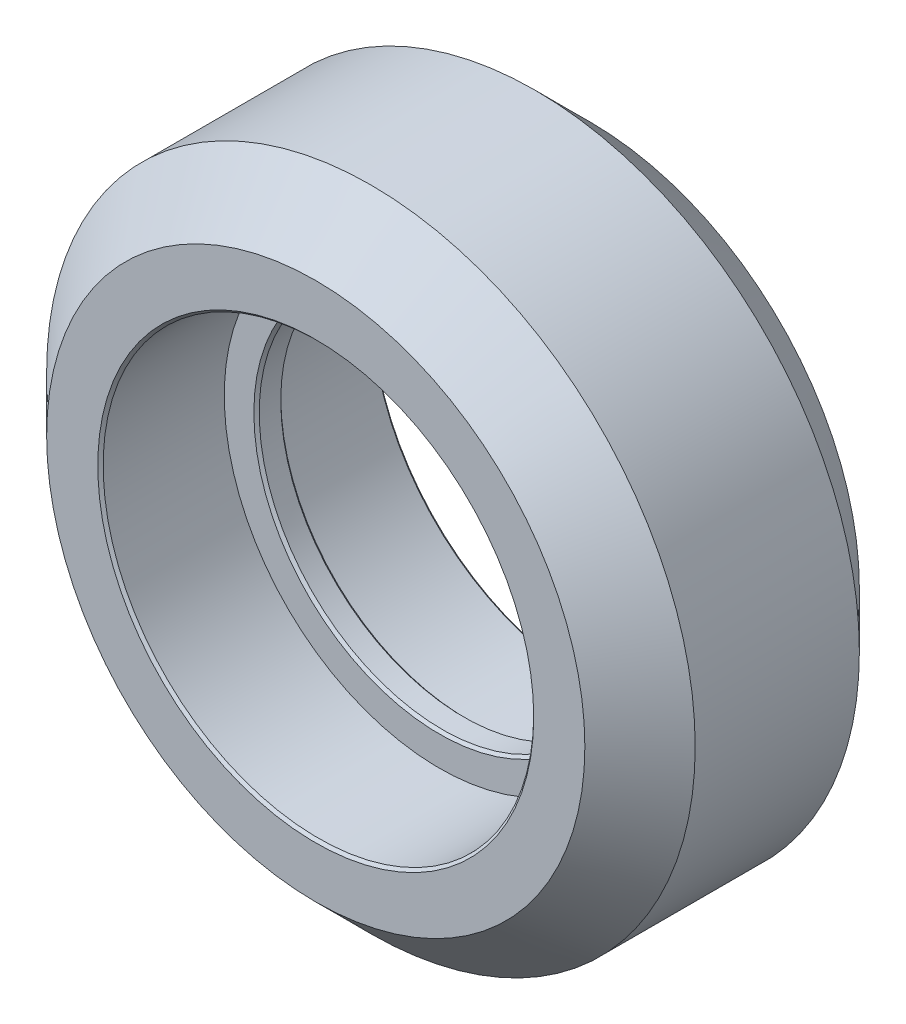
ISO-10303-21;
HEADER;
FILE_DESCRIPTION(('STEP AP214'),'2;1');
FILE_NAME('part.step','',(''),(''),'','','');
FILE_SCHEMA(('AUTOMOTIVE_DESIGN { 1 0 10303 214 1 1 1 1 }'));
ENDSEC;
DATA;
#1=APPLICATION_CONTEXT('core data for automotive mechanical design processes');
#2=APPLICATION_PROTOCOL_DEFINITION('international standard','automotive_design',2000,#1);
#3=PRODUCT_CONTEXT('',#1,'mechanical');
#4=PRODUCT('Part','Part','',(#3));
#5=PRODUCT_RELATED_PRODUCT_CATEGORY('part','',(#4));
#6=PRODUCT_DEFINITION_FORMATION('','',#4);
#7=PRODUCT_DEFINITION_CONTEXT('part definition',#1,'design');
#8=PRODUCT_DEFINITION('design','',#6,#7);
#9=PRODUCT_DEFINITION_SHAPE('','',#8);
#10=(LENGTH_UNIT() NAMED_UNIT(*) SI_UNIT(.MILLI.,.METRE.));
#11=(NAMED_UNIT(*) PLANE_ANGLE_UNIT() SI_UNIT($,.RADIAN.));
#12=(NAMED_UNIT(*) SI_UNIT($,.STERADIAN.) SOLID_ANGLE_UNIT());
#13=UNCERTAINTY_MEASURE_WITH_UNIT(LENGTH_MEASURE(1.E-05),#10,'distance_accuracy_value','');
#14=(GEOMETRIC_REPRESENTATION_CONTEXT(3) GLOBAL_UNCERTAINTY_ASSIGNED_CONTEXT((#13)) GLOBAL_UNIT_ASSIGNED_CONTEXT((#10,
#11,#12)) REPRESENTATION_CONTEXT('',''));
#15=CARTESIAN_POINT('',(0.,0.,0.));
#16=DIRECTION('',(0.,0.,1.));
#17=DIRECTION('',(1.,0.,0.));
#18=AXIS2_PLACEMENT_3D('',#15,#16,#17);
#19=CARTESIAN_POINT('',(15.5,-35.5,-38.35));
#20=DIRECTION('',(0.,0.,1.));
#21=DIRECTION('',(1.,0.,0.));
#22=AXIS2_PLACEMENT_3D('',#19,#20,#21);
#23=CYLINDRICAL_SURFACE('',#22,6.8);
#24=CARTESIAN_POINT('',(15.5,-35.5,-13.8499999999908));
#25=DIRECTION('',(0.,0.,-1.));
#26=DIRECTION('',(-1.,0.,0.));
#27=AXIS2_PLACEMENT_3D('',#24,#25,#26);
#28=CIRCLE('',#27,6.79999999991014);
#29=CARTESIAN_POINT('',(8.70000000008986,-35.5,-13.8499999999908));
#30=VERTEX_POINT('',#29);
#31=EDGE_CURVE('E41',#30,#30,#28,.T.);
#32=ORIENTED_EDGE('',*,*,#31,.T.);
#33=EDGE_LOOP('',(#32));
#34=FACE_BOUND('',#33,.T.);
#35=CARTESIAN_POINT('',(15.5,-35.5,-13.0500000000211));
#36=DIRECTION('',(0.,0.,1.));
#37=DIRECTION('',(1.,0.,0.));
#38=AXIS2_PLACEMENT_3D('',#35,#36,#37);
#39=CIRCLE('',#38,6.7999999999729);
#40=CARTESIAN_POINT('',(22.2999999999729,-35.5,-13.0500000000211));
#41=VERTEX_POINT('',#40);
#42=EDGE_CURVE('E38',#41,#41,#39,.T.);
#43=ORIENTED_EDGE('',*,*,#42,.T.);
#44=EDGE_LOOP('',(#43));
#45=FACE_BOUND('',#44,.T.);
#46=ADVANCED_FACE('F15',(#34,#45),#23,.F.);
#47=CARTESIAN_POINT('',(15.5,-35.5,-13.9499999999089));
#48=DIRECTION('',(0.,0.,-1.));
#49=DIRECTION('',(-1.,0.,0.));
#50=AXIS2_PLACEMENT_3D('',#47,#48,#49);
#51=CONICAL_SURFACE('',#50,6.8999999998282,0.785398163397448);
#52=ORIENTED_EDGE('',*,*,#31,.F.);
#53=EDGE_LOOP('',(#52));
#54=FACE_BOUND('',#53,.T.);
#55=CARTESIAN_POINT('',(15.5,-35.5,-13.9500000000226));
#56=DIRECTION('',(0.,0.,-1.));
#57=DIRECTION('',(-1.,0.,0.));
#58=AXIS2_PLACEMENT_3D('',#55,#56,#57);
#59=CIRCLE('',#58,6.89999999994188);
#60=CARTESIAN_POINT('',(8.60000000005812,-35.5,-13.9500000000226));
#61=VERTEX_POINT('',#60);
#62=EDGE_CURVE('E18',#61,#61,#59,.F.);
#63=ORIENTED_EDGE('',*,*,#62,.F.);
#64=EDGE_LOOP('',(#63));
#65=FACE_BOUND('',#64,.T.);
#66=ADVANCED_FACE('F67',(#54,#65),#51,.F.);
#67=CARTESIAN_POINT('',(15.5,-35.5,-12.950000000103));
#68=DIRECTION('',(0.,0.,1.));
#69=DIRECTION('',(1.,0.,0.));
#70=AXIS2_PLACEMENT_3D('',#67,#68,#69);
#71=CONICAL_SURFACE('',#70,6.89999999989095,0.785398163397448);
#72=ORIENTED_EDGE('',*,*,#42,.F.);
#73=EDGE_LOOP('',(#72));
#74=FACE_BOUND('',#73,.T.);
#75=CARTESIAN_POINT('',(15.5,-35.5,-12.9499999999894));
#76=DIRECTION('',(0.,0.,1.));
#77=DIRECTION('',(1.,0.,0.));
#78=AXIS2_PLACEMENT_3D('',#75,#76,#77);
#79=CIRCLE('',#78,6.90000000000464);
#80=CARTESIAN_POINT('',(22.4000000000046,-35.5,-12.9499999999894));
#81=VERTEX_POINT('',#80);
#82=EDGE_CURVE('E58',#81,#81,#79,.F.);
#83=ORIENTED_EDGE('',*,*,#82,.F.);
#84=EDGE_LOOP('',(#83));
#85=FACE_BOUND('',#84,.T.);
#86=ADVANCED_FACE('F69',(#74,#85),#71,.F.);
#87=CARTESIAN_POINT('',(15.5,-35.5,-13.95));
#88=DIRECTION('',(0.,0.,-1.));
#89=DIRECTION('',(-1.,0.,0.));
#90=AXIS2_PLACEMENT_3D('',#87,#88,#89);
#91=PLANE('',#90);
#92=CARTESIAN_POINT('',(15.5,-35.5,-13.95));
#93=DIRECTION('',(0.,0.,-1.));
#94=DIRECTION('',(-1.,0.,0.));
#95=AXIS2_PLACEMENT_3D('',#92,#93,#94);
#96=CIRCLE('',#95,8.);
#97=CARTESIAN_POINT('',(7.5,-35.5,-13.95));
#98=VERTEX_POINT('',#97);
#99=EDGE_CURVE('E56',#98,#98,#96,.T.);
#100=ORIENTED_EDGE('',*,*,#99,.T.);
#101=EDGE_LOOP('',(#100));
#102=FACE_BOUND('',#101,.T.);
#103=ORIENTED_EDGE('',*,*,#62,.T.);
#104=EDGE_LOOP('',(#103));
#105=FACE_BOUND('',#104,.T.);
#106=ADVANCED_FACE('F65',(#102,#105),#91,.T.);
#107=CARTESIAN_POINT('',(15.5,-35.5,-12.95));
#108=DIRECTION('',(0.,0.,1.));
#109=DIRECTION('',(1.,0.,0.));
#110=AXIS2_PLACEMENT_3D('',#107,#108,#109);
#111=PLANE('',#110);
#112=CARTESIAN_POINT('',(15.5,-35.5,-12.95));
#113=DIRECTION('',(0.,0.,1.));
#114=DIRECTION('',(1.,0.,0.));
#115=AXIS2_PLACEMENT_3D('',#112,#113,#114);
#116=CIRCLE('',#115,8.);
#117=CARTESIAN_POINT('',(23.5,-35.5,-12.95));
#118=VERTEX_POINT('',#117);
#119=EDGE_CURVE('E37',#118,#118,#116,.T.);
#120=ORIENTED_EDGE('',*,*,#119,.T.);
#121=EDGE_LOOP('',(#120));
#122=FACE_BOUND('',#121,.T.);
#123=ORIENTED_EDGE('',*,*,#82,.T.);
#124=EDGE_LOOP('',(#123));
#125=FACE_BOUND('',#124,.T.);
#126=ADVANCED_FACE('F118',(#122,#125),#111,.T.);
#127=CARTESIAN_POINT('',(15.5,-35.5,-13.95));
#128=DIRECTION('',(0.,0.,-1.));
#129=DIRECTION('',(-1.,0.,0.));
#130=AXIS2_PLACEMENT_3D('',#127,#128,#129);
#131=CYLINDRICAL_SURFACE('',#130,8.);
#132=CARTESIAN_POINT('',(15.5,-35.5,-18.45));
#133=DIRECTION('',(0.,0.,-1.));
#134=DIRECTION('',(-1.,0.,0.));
#135=AXIS2_PLACEMENT_3D('',#132,#133,#134);
#136=CIRCLE('',#135,8.);
#137=CARTESIAN_POINT('',(7.5,-35.5,-18.45));
#138=VERTEX_POINT('',#137);
#139=EDGE_CURVE('E34',#138,#138,#136,.T.);
#140=ORIENTED_EDGE('',*,*,#139,.T.);
#141=EDGE_LOOP('',(#140));
#142=FACE_BOUND('',#141,.T.);
#143=ORIENTED_EDGE('',*,*,#99,.F.);
#144=EDGE_LOOP('',(#143));
#145=FACE_BOUND('',#144,.T.);
#146=ADVANCED_FACE('F114',(#142,#145),#131,.F.);
#147=CARTESIAN_POINT('',(15.5,-35.5,-12.95));
#148=DIRECTION('',(0.,0.,1.));
#149=DIRECTION('',(1.,0.,0.));
#150=AXIS2_PLACEMENT_3D('',#147,#148,#149);
#151=CYLINDRICAL_SURFACE('',#150,8.);
#152=ORIENTED_EDGE('',*,*,#119,.F.);
#153=EDGE_LOOP('',(#152));
#154=FACE_BOUND('',#153,.T.);
#155=CARTESIAN_POINT('',(15.5,-35.5,-8.45));
#156=DIRECTION('',(0.,0.,1.));
#157=DIRECTION('',(1.,0.,0.));
#158=AXIS2_PLACEMENT_3D('',#155,#156,#157);
#159=CIRCLE('',#158,8.);
#160=CARTESIAN_POINT('',(23.5,-35.5,-8.45));
#161=VERTEX_POINT('',#160);
#162=EDGE_CURVE('E30',#161,#161,#159,.T.);
#163=ORIENTED_EDGE('',*,*,#162,.T.);
#164=EDGE_LOOP('',(#163));
#165=FACE_BOUND('',#164,.T.);
#166=ADVANCED_FACE('F110',(#154,#165),#151,.F.);
#167=CARTESIAN_POINT('',(15.5,-35.5,-18.55));
#168=DIRECTION('',(0.,0.,-1.));
#169=DIRECTION('',(-1.,0.,0.));
#170=AXIS2_PLACEMENT_3D('',#167,#168,#169);
#171=CONICAL_SURFACE('',#170,8.1,0.785398163397448);
#172=CARTESIAN_POINT('',(15.5,-35.5,-18.55));
#173=DIRECTION('',(0.,0.,-1.));
#174=DIRECTION('',(-1.,0.,0.));
#175=AXIS2_PLACEMENT_3D('',#172,#173,#174);
#176=CIRCLE('',#175,8.1);
#177=CARTESIAN_POINT('',(7.4,-35.5,-18.55));
#178=VERTEX_POINT('',#177);
#179=EDGE_CURVE('E33',#178,#178,#176,.T.);
#180=ORIENTED_EDGE('',*,*,#179,.T.);
#181=EDGE_LOOP('',(#180));
#182=FACE_BOUND('',#181,.T.);
#183=ORIENTED_EDGE('',*,*,#139,.F.);
#184=EDGE_LOOP('',(#183));
#185=FACE_BOUND('',#184,.T.);
#186=ADVANCED_FACE('F106',(#182,#185),#171,.F.);
#187=CARTESIAN_POINT('',(15.5,-35.5,-8.35));
#188=DIRECTION('',(0.,0.,1.));
#189=DIRECTION('',(1.,0.,0.));
#190=AXIS2_PLACEMENT_3D('',#187,#188,#189);
#191=CONICAL_SURFACE('',#190,8.1,0.785398163397448);
#192=ORIENTED_EDGE('',*,*,#162,.F.);
#193=EDGE_LOOP('',(#192));
#194=FACE_BOUND('',#193,.T.);
#195=CARTESIAN_POINT('',(15.5,-35.5,-8.35));
#196=DIRECTION('',(0.,0.,1.));
#197=DIRECTION('',(1.,0.,0.));
#198=AXIS2_PLACEMENT_3D('',#195,#196,#197);
#199=CIRCLE('',#198,8.1);
#200=CARTESIAN_POINT('',(23.6,-35.5,-8.35));
#201=VERTEX_POINT('',#200);
#202=EDGE_CURVE('E49',#201,#201,#199,.F.);
#203=ORIENTED_EDGE('',*,*,#202,.F.);
#204=EDGE_LOOP('',(#203));
#205=FACE_BOUND('',#204,.T.);
#206=ADVANCED_FACE('F102',(#194,#205),#191,.F.);
#207=CARTESIAN_POINT('',(15.5,-35.5,-18.55));
#208=DIRECTION('',(0.,0.,1.));
#209=DIRECTION('',(1.,0.,0.));
#210=AXIS2_PLACEMENT_3D('',#207,#208,#209);
#211=PLANE('',#210);
#212=CARTESIAN_POINT('',(15.5,-35.5,-18.55));
#213=DIRECTION('',(0.,0.,1.));
#214=DIRECTION('',(1.,0.,0.));
#215=AXIS2_PLACEMENT_3D('',#212,#213,#214);
#216=CIRCLE('',#215,10.);
#217=CARTESIAN_POINT('',(25.5,-35.5,-18.55));
#218=VERTEX_POINT('',#217);
#219=EDGE_CURVE('E46',#218,#218,#216,.T.);
#220=ORIENTED_EDGE('',*,*,#219,.F.);
#221=EDGE_LOOP('',(#220));
#222=FACE_BOUND('',#221,.T.);
#223=ORIENTED_EDGE('',*,*,#179,.F.);
#224=EDGE_LOOP('',(#223));
#225=FACE_BOUND('',#224,.T.);
#226=ADVANCED_FACE('F98',(#222,#225),#211,.F.);
#227=CARTESIAN_POINT('',(15.5,-35.5,-8.35));
#228=DIRECTION('',(0.,0.,1.));
#229=DIRECTION('',(1.,0.,0.));
#230=AXIS2_PLACEMENT_3D('',#227,#228,#229);
#231=PLANE('',#230);
#232=CARTESIAN_POINT('',(15.5,-35.5,-8.35));
#233=DIRECTION('',(0.,0.,-1.));
#234=DIRECTION('',(-1.,0.,0.));
#235=AXIS2_PLACEMENT_3D('',#232,#233,#234);
#236=CIRCLE('',#235,10.);
#237=CARTESIAN_POINT('',(5.5,-35.5,-8.35));
#238=VERTEX_POINT('',#237);
#239=EDGE_CURVE('E27',#238,#238,#236,.T.);
#240=ORIENTED_EDGE('',*,*,#239,.F.);
#241=EDGE_LOOP('',(#240));
#242=FACE_BOUND('',#241,.T.);
#243=ORIENTED_EDGE('',*,*,#202,.T.);
#244=EDGE_LOOP('',(#243));
#245=FACE_BOUND('',#244,.T.);
#246=ADVANCED_FACE('F94',(#242,#245),#231,.T.);
#247=CARTESIAN_POINT('',(15.5,-35.5,-16.5));
#248=DIRECTION('',(0.,0.,1.));
#249=DIRECTION('',(1.,0.,0.));
#250=AXIS2_PLACEMENT_3D('',#247,#248,#249);
#251=CONICAL_SURFACE('',#250,12.05,0.785398163397448);
#252=CARTESIAN_POINT('',(15.5,-35.5,-16.5));
#253=DIRECTION('',(0.,0.,1.));
#254=DIRECTION('',(1.,0.,0.));
#255=AXIS2_PLACEMENT_3D('',#252,#253,#254);
#256=CIRCLE('',#255,12.05);
#257=CARTESIAN_POINT('',(27.55,-35.5,-16.5));
#258=VERTEX_POINT('',#257);
#259=EDGE_CURVE('E22',#258,#258,#256,.T.);
#260=ORIENTED_EDGE('',*,*,#259,.F.);
#261=EDGE_LOOP('',(#260));
#262=FACE_BOUND('',#261,.T.);
#263=ORIENTED_EDGE('',*,*,#219,.T.);
#264=EDGE_LOOP('',(#263));
#265=FACE_BOUND('',#264,.T.);
#266=ADVANCED_FACE('F87',(#262,#265),#251,.T.);
#267=CARTESIAN_POINT('',(15.5,-35.5,-10.4));
#268=DIRECTION('',(0.,0.,-1.));
#269=DIRECTION('',(-1.,0.,0.));
#270=AXIS2_PLACEMENT_3D('',#267,#268,#269);
#271=CONICAL_SURFACE('',#270,12.05,0.785398163397448);
#272=CARTESIAN_POINT('',(15.5,-35.5,-10.4));
#273=DIRECTION('',(0.,0.,1.));
#274=DIRECTION('',(1.,0.,0.));
#275=AXIS2_PLACEMENT_3D('',#272,#273,#274);
#276=CIRCLE('',#275,12.05);
#277=CARTESIAN_POINT('',(27.55,-35.5,-10.4));
#278=VERTEX_POINT('',#277);
#279=EDGE_CURVE('E10',#278,#278,#276,.F.);
#280=ORIENTED_EDGE('',*,*,#279,.F.);
#281=EDGE_LOOP('',(#280));
#282=FACE_BOUND('',#281,.T.);
#283=ORIENTED_EDGE('',*,*,#239,.T.);
#284=EDGE_LOOP('',(#283));
#285=FACE_BOUND('',#284,.T.);
#286=ADVANCED_FACE('F82',(#282,#285),#271,.T.);
#287=CARTESIAN_POINT('',(15.5,-35.5,-16.));
#288=DIRECTION('',(0.,0.,1.));
#289=DIRECTION('',(1.,0.,0.));
#290=AXIS2_PLACEMENT_3D('',#287,#288,#289);
#291=CYLINDRICAL_SURFACE('',#290,12.05);
#292=ORIENTED_EDGE('',*,*,#279,.T.);
#293=EDGE_LOOP('',(#292));
#294=FACE_BOUND('',#293,.T.);
#295=ORIENTED_EDGE('',*,*,#259,.T.);
#296=EDGE_LOOP('',(#295));
#297=FACE_BOUND('',#296,.T.);
#298=ADVANCED_FACE('F80',(#294,#297),#291,.T.);
#299=CLOSED_SHELL('',(#46,#66,#86,#106,#126,#146,#166,#186,#206,#226,#246,#266,#286,#298));
#300=MANIFOLD_SOLID_BREP('B1',#299);
#301=ADVANCED_BREP_SHAPE_REPRESENTATION('',(#18,#300),#14);
#302=SHAPE_DEFINITION_REPRESENTATION(#9,#301);
ENDSEC;
END-ISO-10303-21;
